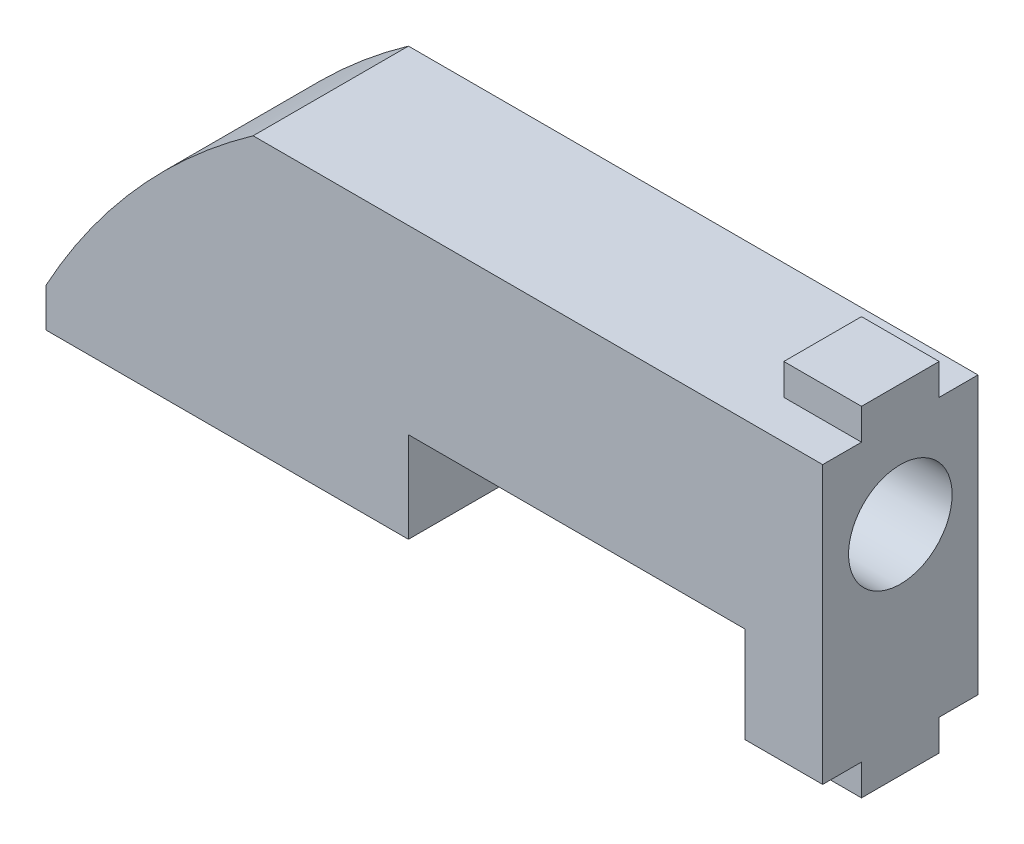
ISO-10303-21;
HEADER;
FILE_DESCRIPTION(('STEP AP214'),'2;1');
FILE_NAME('part.step','',(''),(''),'','','');
FILE_SCHEMA(('AUTOMOTIVE_DESIGN { 1 0 10303 214 1 1 1 1 }'));
ENDSEC;
DATA;
#1=APPLICATION_CONTEXT('core data for automotive mechanical design processes');
#2=APPLICATION_PROTOCOL_DEFINITION('international standard','automotive_design',2000,#1);
#3=PRODUCT_CONTEXT('',#1,'mechanical');
#4=PRODUCT('Part','Part','',(#3));
#5=PRODUCT_RELATED_PRODUCT_CATEGORY('part','',(#4));
#6=PRODUCT_DEFINITION_FORMATION('','',#4);
#7=PRODUCT_DEFINITION_CONTEXT('part definition',#1,'design');
#8=PRODUCT_DEFINITION('design','',#6,#7);
#9=PRODUCT_DEFINITION_SHAPE('','',#8);
#10=(LENGTH_UNIT() NAMED_UNIT(*) SI_UNIT(.MILLI.,.METRE.));
#11=(NAMED_UNIT(*) PLANE_ANGLE_UNIT() SI_UNIT($,.RADIAN.));
#12=(NAMED_UNIT(*) SI_UNIT($,.STERADIAN.) SOLID_ANGLE_UNIT());
#13=UNCERTAINTY_MEASURE_WITH_UNIT(LENGTH_MEASURE(1.E-05),#10,'distance_accuracy_value','');
#14=(GEOMETRIC_REPRESENTATION_CONTEXT(3) GLOBAL_UNCERTAINTY_ASSIGNED_CONTEXT((#13)) GLOBAL_UNIT_ASSIGNED_CONTEXT((#10,
#11,#12)) REPRESENTATION_CONTEXT('',''));
#15=CARTESIAN_POINT('',(0.,0.,0.));
#16=DIRECTION('',(0.,0.,1.));
#17=DIRECTION('',(1.,0.,0.));
#18=AXIS2_PLACEMENT_3D('',#15,#16,#17);
#19=CARTESIAN_POINT('',(30.,10.5,3.));
#20=DIRECTION('',(-1.,0.,0.));
#21=DIRECTION('',(0.,-1.,0.));
#22=AXIS2_PLACEMENT_3D('',#19,#20,#21);
#23=PLANE('',#22);
#24=DIRECTION('',(0.,1.,0.));
#25=VECTOR('',#24,1.);
#26=CARTESIAN_POINT('',(30.,10.5,-3.));
#27=LINE('',#26,#25);
#28=CARTESIAN_POINT('',(30.,-0.199999999999999,-3.));
#29=VERTEX_POINT('',#28);
#30=CARTESIAN_POINT('',(30.,10.5,-3.));
#31=VERTEX_POINT('',#30);
#32=EDGE_CURVE('E318',#29,#31,#27,.T.);
#33=ORIENTED_EDGE('',*,*,#32,.T.);
#34=DIRECTION('',(0.,0.,-1.));
#35=VECTOR('',#34,1.);
#36=CARTESIAN_POINT('',(30.,10.5,3.));
#37=LINE('',#36,#35);
#38=CARTESIAN_POINT('',(30.,10.5,-1.5));
#39=VERTEX_POINT('',#38);
#40=EDGE_CURVE('E258',#39,#31,#37,.T.);
#41=ORIENTED_EDGE('',*,*,#40,.F.);
#42=DIRECTION('',(0.,-1.,0.));
#43=VECTOR('',#42,1.);
#44=CARTESIAN_POINT('',(30.,11.7,-1.5));
#45=LINE('',#44,#43);
#46=CARTESIAN_POINT('',(30.,11.7,-1.5));
#47=VERTEX_POINT('',#46);
#48=EDGE_CURVE('E266',#47,#39,#45,.T.);
#49=ORIENTED_EDGE('',*,*,#48,.F.);
#50=DIRECTION('',(0.,0.,-1.));
#51=VECTOR('',#50,1.);
#52=CARTESIAN_POINT('',(30.,11.7,-1.5));
#53=LINE('',#52,#51);
#54=CARTESIAN_POINT('',(30.,11.7,1.5));
#55=VERTEX_POINT('',#54);
#56=EDGE_CURVE('E276',#55,#47,#53,.T.);
#57=ORIENTED_EDGE('',*,*,#56,.F.);
#58=DIRECTION('',(0.,-1.,0.));
#59=VECTOR('',#58,1.);
#60=CARTESIAN_POINT('',(30.,11.7,1.5));
#61=LINE('',#60,#59);
#62=CARTESIAN_POINT('',(30.,10.5,1.5));
#63=VERTEX_POINT('',#62);
#64=EDGE_CURVE('E277',#55,#63,#61,.T.);
#65=ORIENTED_EDGE('',*,*,#64,.T.);
#66=CARTESIAN_POINT('',(30.,10.5,3.));
#67=VERTEX_POINT('',#66);
#68=EDGE_CURVE('E229',#67,#63,#37,.T.);
#69=ORIENTED_EDGE('',*,*,#68,.F.);
#70=DIRECTION('',(0.,1.,0.));
#71=VECTOR('',#70,1.);
#72=CARTESIAN_POINT('',(30.,10.5,3.));
#73=LINE('',#72,#71);
#74=CARTESIAN_POINT('',(30.,-0.199999999999999,3.));
#75=VERTEX_POINT('',#74);
#76=EDGE_CURVE('E226',#75,#67,#73,.T.);
#77=ORIENTED_EDGE('',*,*,#76,.F.);
#78=DIRECTION('',(0.,0.,-1.));
#79=VECTOR('',#78,1.);
#80=CARTESIAN_POINT('',(30.,-0.199999999999999,3.));
#81=LINE('',#80,#79);
#82=CARTESIAN_POINT('',(30.,-0.199999999999999,1.5));
#83=VERTEX_POINT('',#82);
#84=EDGE_CURVE('E224',#75,#83,#81,.T.);
#85=ORIENTED_EDGE('',*,*,#84,.T.);
#86=DIRECTION('',(0.,1.,0.));
#87=VECTOR('',#86,1.);
#88=CARTESIAN_POINT('',(30.,-1.4,1.5));
#89=LINE('',#88,#87);
#90=CARTESIAN_POINT('',(30.,-1.4,1.5));
#91=VERTEX_POINT('',#90);
#92=EDGE_CURVE('E199',#91,#83,#89,.T.);
#93=ORIENTED_EDGE('',*,*,#92,.F.);
#94=DIRECTION('',(0.,0.,1.));
#95=VECTOR('',#94,1.);
#96=CARTESIAN_POINT('',(30.,-1.4,1.5));
#97=LINE('',#96,#95);
#98=CARTESIAN_POINT('',(30.,-1.4,-1.5));
#99=VERTEX_POINT('',#98);
#100=EDGE_CURVE('E180',#99,#91,#97,.T.);
#101=ORIENTED_EDGE('',*,*,#100,.F.);
#102=DIRECTION('',(0.,1.,0.));
#103=VECTOR('',#102,1.);
#104=CARTESIAN_POINT('',(30.,-1.4,-1.5));
#105=LINE('',#104,#103);
#106=CARTESIAN_POINT('',(30.,-0.199999999999999,-1.5));
#107=VERTEX_POINT('',#106);
#108=EDGE_CURVE('E195',#99,#107,#105,.T.);
#109=ORIENTED_EDGE('',*,*,#108,.T.);
#110=EDGE_CURVE('E227',#107,#29,#81,.T.);
#111=ORIENTED_EDGE('',*,*,#110,.T.);
#112=EDGE_LOOP('',(#33,#41,#49,#57,#65,#69,#77,#85,#93,#101,#109,#111));
#113=FACE_BOUND('',#112,.T.);
#114=CARTESIAN_POINT('',(30.,7.,0.));
#115=DIRECTION('',(1.,0.,0.));
#116=DIRECTION('',(0.,0.,-1.));
#117=AXIS2_PLACEMENT_3D('',#114,#115,#116);
#118=CIRCLE('',#117,2.);
#119=CARTESIAN_POINT('',(30.,7.,-2.));
#120=VERTEX_POINT('',#119);
#121=EDGE_CURVE('E169',#120,#120,#118,.T.);
#122=ORIENTED_EDGE('',*,*,#121,.F.);
#123=EDGE_LOOP('',(#122));
#124=FACE_BOUND('',#123,.T.);
#125=ADVANCED_FACE('F37',(#113,#124),#23,.F.);
#126=CARTESIAN_POINT('',(27.,-0.199999999999999,3.));
#127=DIRECTION('',(0.,1.,0.));
#128=DIRECTION('',(0.,0.,1.));
#129=AXIS2_PLACEMENT_3D('',#126,#127,#128);
#130=PLANE('',#129);
#131=DIRECTION('',(-1.,0.,0.));
#132=VECTOR('',#131,1.);
#133=CARTESIAN_POINT('',(27.,-0.199999999999999,1.5));
#134=LINE('',#133,#132);
#135=CARTESIAN_POINT('',(27.,-0.199999999999999,1.5));
#136=VERTEX_POINT('',#135);
#137=EDGE_CURVE('E178',#83,#136,#134,.T.);
#138=ORIENTED_EDGE('',*,*,#137,.F.);
#139=ORIENTED_EDGE('',*,*,#84,.F.);
#140=DIRECTION('',(1.,0.,0.));
#141=VECTOR('',#140,1.);
#142=CARTESIAN_POINT('',(27.,-0.199999999999999,3.));
#143=LINE('',#142,#141);
#144=CARTESIAN_POINT('',(27.,-0.199999999999999,3.));
#145=VERTEX_POINT('',#144);
#146=EDGE_CURVE('E297',#145,#75,#143,.T.);
#147=ORIENTED_EDGE('',*,*,#146,.F.);
#148=DIRECTION('',(0.,0.,-1.));
#149=VECTOR('',#148,1.);
#150=CARTESIAN_POINT('',(27.,-0.199999999999999,3.));
#151=LINE('',#150,#149);
#152=EDGE_CURVE('E62',#145,#136,#151,.T.);
#153=ORIENTED_EDGE('',*,*,#152,.T.);
#154=EDGE_LOOP('',(#138,#139,#147,#153));
#155=FACE_BOUND('',#154,.T.);
#156=ADVANCED_FACE('F395',(#155),#130,.F.);
#157=DIRECTION('',(1.,0.,0.));
#158=VECTOR('',#157,1.);
#159=CARTESIAN_POINT('',(27.,-0.199999999999999,-1.5));
#160=LINE('',#159,#158);
#161=CARTESIAN_POINT('',(27.,-0.199999999999999,-1.5));
#162=VERTEX_POINT('',#161);
#163=EDGE_CURVE('E54',#162,#107,#160,.T.);
#164=ORIENTED_EDGE('',*,*,#163,.F.);
#165=CARTESIAN_POINT('',(27.,-0.199999999999999,-3.));
#166=VERTEX_POINT('',#165);
#167=EDGE_CURVE('E192',#162,#166,#151,.T.);
#168=ORIENTED_EDGE('',*,*,#167,.T.);
#169=DIRECTION('',(1.,0.,0.));
#170=VECTOR('',#169,1.);
#171=CARTESIAN_POINT('',(27.,-0.199999999999999,-3.));
#172=LINE('',#171,#170);
#173=EDGE_CURVE('E315',#166,#29,#172,.T.);
#174=ORIENTED_EDGE('',*,*,#173,.T.);
#175=ORIENTED_EDGE('',*,*,#110,.F.);
#176=EDGE_LOOP('',(#164,#168,#174,#175));
#177=FACE_BOUND('',#176,.T.);
#178=ADVANCED_FACE('F380',(#177),#130,.F.);
#179=CARTESIAN_POINT('',(8.,10.5,3.));
#180=DIRECTION('',(0.,-1.,0.));
#181=DIRECTION('',(0.,0.,-1.));
#182=AXIS2_PLACEMENT_3D('',#179,#180,#181);
#183=PLANE('',#182);
#184=DIRECTION('',(1.,0.,0.));
#185=VECTOR('',#184,1.);
#186=CARTESIAN_POINT('',(30.,10.5,1.5));
#187=LINE('',#186,#185);
#188=CARTESIAN_POINT('',(27.,10.5,1.5));
#189=VERTEX_POINT('',#188);
#190=EDGE_CURVE('E273',#189,#63,#187,.T.);
#191=ORIENTED_EDGE('',*,*,#190,.F.);
#192=DIRECTION('',(0.,0.,1.));
#193=VECTOR('',#192,1.);
#194=CARTESIAN_POINT('',(27.,10.5,-1.5));
#195=LINE('',#194,#193);
#196=CARTESIAN_POINT('',(27.,10.5,-1.5));
#197=VERTEX_POINT('',#196);
#198=EDGE_CURVE('E263',#197,#189,#195,.T.);
#199=ORIENTED_EDGE('',*,*,#198,.F.);
#200=DIRECTION('',(-1.,0.,0.));
#201=VECTOR('',#200,1.);
#202=CARTESIAN_POINT('',(30.,10.5,-1.5));
#203=LINE('',#202,#201);
#204=EDGE_CURVE('E204',#39,#197,#203,.T.);
#205=ORIENTED_EDGE('',*,*,#204,.F.);
#206=ORIENTED_EDGE('',*,*,#40,.T.);
#207=DIRECTION('',(-1.,0.,0.));
#208=VECTOR('',#207,1.);
#209=CARTESIAN_POINT('',(8.,10.5,-3.));
#210=LINE('',#209,#208);
#211=CARTESIAN_POINT('',(8.,10.5,-3.));
#212=VERTEX_POINT('',#211);
#213=EDGE_CURVE('E320',#31,#212,#210,.T.);
#214=ORIENTED_EDGE('',*,*,#213,.T.);
#215=DIRECTION('',(0.,0.,-1.));
#216=VECTOR('',#215,1.);
#217=CARTESIAN_POINT('',(8.,10.5,3.));
#218=LINE('',#217,#216);
#219=CARTESIAN_POINT('',(8.,10.5,3.));
#220=VERTEX_POINT('',#219);
#221=EDGE_CURVE('E260',#220,#212,#218,.T.);
#222=ORIENTED_EDGE('',*,*,#221,.F.);
#223=DIRECTION('',(-1.,0.,0.));
#224=VECTOR('',#223,1.);
#225=CARTESIAN_POINT('',(8.,10.5,3.));
#226=LINE('',#225,#224);
#227=EDGE_CURVE('E300',#67,#220,#226,.T.);
#228=ORIENTED_EDGE('',*,*,#227,.F.);
#229=ORIENTED_EDGE('',*,*,#68,.T.);
#230=EDGE_LOOP('',(#191,#199,#205,#206,#214,#222,#228,#229));
#231=FACE_BOUND('',#230,.T.);
#232=ADVANCED_FACE('F354',(#231),#183,.F.);
#233=CARTESIAN_POINT('',(14.,0.,3.));
#234=DIRECTION('',(0.,1.,0.));
#235=DIRECTION('',(-1.,0.,0.));
#236=AXIS2_PLACEMENT_3D('',#233,#234,#235);
#237=PLANE('',#236);
#238=DIRECTION('',(1.,0.,0.));
#239=VECTOR('',#238,1.);
#240=CARTESIAN_POINT('',(14.,0.,-3.));
#241=LINE('',#240,#239);
#242=CARTESIAN_POINT('',(0.,0.,-3.));
#243=VERTEX_POINT('',#242);
#244=CARTESIAN_POINT('',(14.,0.,-3.));
#245=VERTEX_POINT('',#244);
#246=EDGE_CURVE('E269',#243,#245,#241,.T.);
#247=ORIENTED_EDGE('',*,*,#246,.T.);
#248=DIRECTION('',(0.,0.,-1.));
#249=VECTOR('',#248,1.);
#250=CARTESIAN_POINT('',(14.,0.,3.));
#251=LINE('',#250,#249);
#252=CARTESIAN_POINT('',(14.,0.,3.));
#253=VERTEX_POINT('',#252);
#254=EDGE_CURVE('E11',#253,#245,#251,.T.);
#255=ORIENTED_EDGE('',*,*,#254,.F.);
#256=DIRECTION('',(1.,0.,0.));
#257=VECTOR('',#256,1.);
#258=CARTESIAN_POINT('',(14.,0.,3.));
#259=LINE('',#258,#257);
#260=CARTESIAN_POINT('',(0.,0.,3.));
#261=VERTEX_POINT('',#260);
#262=EDGE_CURVE('E287',#261,#253,#259,.T.);
#263=ORIENTED_EDGE('',*,*,#262,.F.);
#264=DIRECTION('',(0.,0.,-1.));
#265=VECTOR('',#264,1.);
#266=CARTESIAN_POINT('',(0.,0.,3.));
#267=LINE('',#266,#265);
#268=EDGE_CURVE('E306',#261,#243,#267,.T.);
#269=ORIENTED_EDGE('',*,*,#268,.T.);
#270=EDGE_LOOP('',(#247,#255,#263,#269));
#271=FACE_BOUND('',#270,.T.);
#272=ADVANCED_FACE('F39',(#271),#237,.F.);
#273=CARTESIAN_POINT('',(14.,3.5,3.));
#274=DIRECTION('',(-1.,0.,0.));
#275=DIRECTION('',(0.,-1.,0.));
#276=AXIS2_PLACEMENT_3D('',#273,#274,#275);
#277=PLANE('',#276);
#278=DIRECTION('',(0.,1.,0.));
#279=VECTOR('',#278,1.);
#280=CARTESIAN_POINT('',(14.,3.5,-3.));
#281=LINE('',#280,#279);
#282=CARTESIAN_POINT('',(14.,3.5,-3.));
#283=VERTEX_POINT('',#282);
#284=EDGE_CURVE('E309',#245,#283,#281,.T.);
#285=ORIENTED_EDGE('',*,*,#284,.T.);
#286=DIRECTION('',(0.,0.,-1.));
#287=VECTOR('',#286,1.);
#288=CARTESIAN_POINT('',(14.,3.5,3.));
#289=LINE('',#288,#287);
#290=CARTESIAN_POINT('',(14.,3.5,3.));
#291=VERTEX_POINT('',#290);
#292=EDGE_CURVE('E46',#291,#283,#289,.T.);
#293=ORIENTED_EDGE('',*,*,#292,.F.);
#294=DIRECTION('',(0.,1.,0.));
#295=VECTOR('',#294,1.);
#296=CARTESIAN_POINT('',(14.,3.5,3.));
#297=LINE('',#296,#295);
#298=EDGE_CURVE('E290',#253,#291,#297,.T.);
#299=ORIENTED_EDGE('',*,*,#298,.F.);
#300=ORIENTED_EDGE('',*,*,#254,.T.);
#301=EDGE_LOOP('',(#285,#293,#299,#300));
#302=FACE_BOUND('',#301,.T.);
#303=ADVANCED_FACE('F391',(#302),#277,.F.);
#304=CARTESIAN_POINT('',(27.,3.5,3.));
#305=DIRECTION('',(0.,1.,0.));
#306=DIRECTION('',(-1.,0.,0.));
#307=AXIS2_PLACEMENT_3D('',#304,#305,#306);
#308=PLANE('',#307);
#309=DIRECTION('',(1.,0.,0.));
#310=VECTOR('',#309,1.);
#311=CARTESIAN_POINT('',(27.,3.5,-3.));
#312=LINE('',#311,#310);
#313=CARTESIAN_POINT('',(27.,3.5,-3.));
#314=VERTEX_POINT('',#313);
#315=EDGE_CURVE('E311',#283,#314,#312,.T.);
#316=ORIENTED_EDGE('',*,*,#315,.T.);
#317=DIRECTION('',(0.,0.,-1.));
#318=VECTOR('',#317,1.);
#319=CARTESIAN_POINT('',(27.,3.5,3.));
#320=LINE('',#319,#318);
#321=CARTESIAN_POINT('',(27.,3.5,3.));
#322=VERTEX_POINT('',#321);
#323=EDGE_CURVE('E242',#322,#314,#320,.T.);
#324=ORIENTED_EDGE('',*,*,#323,.F.);
#325=DIRECTION('',(1.,0.,0.));
#326=VECTOR('',#325,1.);
#327=CARTESIAN_POINT('',(27.,3.5,3.));
#328=LINE('',#327,#326);
#329=EDGE_CURVE('E293',#291,#322,#328,.T.);
#330=ORIENTED_EDGE('',*,*,#329,.F.);
#331=ORIENTED_EDGE('',*,*,#292,.T.);
#332=EDGE_LOOP('',(#316,#324,#330,#331));
#333=FACE_BOUND('',#332,.T.);
#334=ADVANCED_FACE('F384',(#333),#308,.F.);
#335=CARTESIAN_POINT('',(27.,-0.199999999999999,3.));
#336=DIRECTION('',(1.,0.,0.));
#337=DIRECTION('',(0.,1.,0.));
#338=AXIS2_PLACEMENT_3D('',#335,#336,#337);
#339=PLANE('',#338);
#340=DIRECTION('',(0.,-1.,0.));
#341=VECTOR('',#340,1.);
#342=CARTESIAN_POINT('',(27.,-0.199999999999999,-3.));
#343=LINE('',#342,#341);
#344=EDGE_CURVE('E313',#314,#166,#343,.T.);
#345=ORIENTED_EDGE('',*,*,#344,.T.);
#346=ORIENTED_EDGE('',*,*,#167,.F.);
#347=DIRECTION('',(0.,1.,0.));
#348=VECTOR('',#347,1.);
#349=CARTESIAN_POINT('',(27.,-1.4,-1.5));
#350=LINE('',#349,#348);
#351=CARTESIAN_POINT('',(27.,-1.4,-1.5));
#352=VERTEX_POINT('',#351);
#353=EDGE_CURVE('E198',#352,#162,#350,.T.);
#354=ORIENTED_EDGE('',*,*,#353,.F.);
#355=DIRECTION('',(0.,0.,-1.));
#356=VECTOR('',#355,1.);
#357=CARTESIAN_POINT('',(27.,-1.4,1.5));
#358=LINE('',#357,#356);
#359=CARTESIAN_POINT('',(27.,-1.4,1.5));
#360=VERTEX_POINT('',#359);
#361=EDGE_CURVE('E174',#360,#352,#358,.T.);
#362=ORIENTED_EDGE('',*,*,#361,.F.);
#363=DIRECTION('',(0.,1.,0.));
#364=VECTOR('',#363,1.);
#365=CARTESIAN_POINT('',(27.,-1.4,1.5));
#366=LINE('',#365,#364);
#367=EDGE_CURVE('E184',#360,#136,#366,.T.);
#368=ORIENTED_EDGE('',*,*,#367,.T.);
#369=ORIENTED_EDGE('',*,*,#152,.F.);
#370=DIRECTION('',(0.,-1.,0.));
#371=VECTOR('',#370,1.);
#372=CARTESIAN_POINT('',(27.,-0.199999999999999,3.));
#373=LINE('',#372,#371);
#374=EDGE_CURVE('E295',#322,#145,#373,.T.);
#375=ORIENTED_EDGE('',*,*,#374,.F.);
#376=ORIENTED_EDGE('',*,*,#323,.T.);
#377=EDGE_LOOP('',(#345,#346,#354,#362,#368,#369,#375,#376));
#378=FACE_BOUND('',#377,.T.);
#379=ADVANCED_FACE('F382',(#378),#339,.F.);
#380=CARTESIAN_POINT('',(23.3665507302786,-11.2147117602476,3.));
#381=DIRECTION('',(0.,0.,-1.));
#382=DIRECTION('',(-1.,0.,0.));
#383=AXIS2_PLACEMENT_3D('',#380,#381,#382);
#384=CYLINDRICAL_SURFACE('',#383,26.6018718923474);
#385=CARTESIAN_POINT('',(23.3665507302786,-11.2147117602476,-3.));
#386=DIRECTION('',(0.,0.,1.));
#387=DIRECTION('',(1.,0.,0.));
#388=AXIS2_PLACEMENT_3D('',#385,#386,#387);
#389=CIRCLE('',#388,26.6018718923474);
#390=CARTESIAN_POINT('',(0.,1.5,-3.));
#391=VERTEX_POINT('',#390);
#392=EDGE_CURVE('E322',#212,#391,#389,.T.);
#393=ORIENTED_EDGE('',*,*,#392,.T.);
#394=DIRECTION('',(0.,0.,-1.));
#395=VECTOR('',#394,1.);
#396=CARTESIAN_POINT('',(0.,1.5,3.));
#397=LINE('',#396,#395);
#398=CARTESIAN_POINT('',(0.,1.5,3.));
#399=VERTEX_POINT('',#398);
#400=EDGE_CURVE('E327',#399,#391,#397,.T.);
#401=ORIENTED_EDGE('',*,*,#400,.F.);
#402=CARTESIAN_POINT('',(23.3665507302786,-11.2147117602476,3.));
#403=DIRECTION('',(0.,0.,1.));
#404=DIRECTION('',(1.,0.,0.));
#405=AXIS2_PLACEMENT_3D('',#402,#403,#404);
#406=CIRCLE('',#405,26.6018718923474);
#407=EDGE_CURVE('E302',#220,#399,#406,.T.);
#408=ORIENTED_EDGE('',*,*,#407,.F.);
#409=ORIENTED_EDGE('',*,*,#221,.T.);
#410=EDGE_LOOP('',(#393,#401,#408,#409));
#411=FACE_BOUND('',#410,.T.);
#412=ADVANCED_FACE('F335',(#411),#384,.T.);
#413=CARTESIAN_POINT('',(0.,0.,3.));
#414=DIRECTION('',(1.,0.,0.));
#415=DIRECTION('',(0.,0.,-1.));
#416=AXIS2_PLACEMENT_3D('',#413,#414,#415);
#417=PLANE('',#416);
#418=DIRECTION('',(0.,-1.,0.));
#419=VECTOR('',#418,1.);
#420=CARTESIAN_POINT('',(0.,0.,-3.));
#421=LINE('',#420,#419);
#422=EDGE_CURVE('E291',#391,#243,#421,.T.);
#423=ORIENTED_EDGE('',*,*,#422,.T.);
#424=ORIENTED_EDGE('',*,*,#268,.F.);
#425=DIRECTION('',(0.,-1.,0.));
#426=VECTOR('',#425,1.);
#427=CARTESIAN_POINT('',(0.,0.,3.));
#428=LINE('',#427,#426);
#429=EDGE_CURVE('E304',#399,#261,#428,.T.);
#430=ORIENTED_EDGE('',*,*,#429,.F.);
#431=ORIENTED_EDGE('',*,*,#400,.T.);
#432=EDGE_LOOP('',(#423,#424,#430,#431));
#433=FACE_BOUND('',#432,.T.);
#434=ADVANCED_FACE('F347',(#433),#417,.F.);
#435=CARTESIAN_POINT('',(23.3665507302786,-11.2147117602476,3.));
#436=DIRECTION('',(0.,0.,1.));
#437=DIRECTION('',(1.,0.,0.));
#438=AXIS2_PLACEMENT_3D('',#435,#436,#437);
#439=PLANE('',#438);
#440=ORIENTED_EDGE('',*,*,#262,.T.);
#441=ORIENTED_EDGE('',*,*,#298,.T.);
#442=ORIENTED_EDGE('',*,*,#329,.T.);
#443=ORIENTED_EDGE('',*,*,#374,.T.);
#444=ORIENTED_EDGE('',*,*,#146,.T.);
#445=ORIENTED_EDGE('',*,*,#76,.T.);
#446=ORIENTED_EDGE('',*,*,#227,.T.);
#447=ORIENTED_EDGE('',*,*,#407,.T.);
#448=ORIENTED_EDGE('',*,*,#429,.T.);
#449=EDGE_LOOP('',(#440,#441,#442,#443,#444,#445,#446,#447,#448));
#450=FACE_BOUND('',#449,.T.);
#451=ADVANCED_FACE('F353',(#450),#439,.T.);
#452=CARTESIAN_POINT('',(23.3665507302786,-11.2147117602476,-3.));
#453=DIRECTION('',(0.,0.,1.));
#454=DIRECTION('',(1.,0.,0.));
#455=AXIS2_PLACEMENT_3D('',#452,#453,#454);
#456=PLANE('',#455);
#457=ORIENTED_EDGE('',*,*,#246,.F.);
#458=ORIENTED_EDGE('',*,*,#422,.F.);
#459=ORIENTED_EDGE('',*,*,#392,.F.);
#460=ORIENTED_EDGE('',*,*,#213,.F.);
#461=ORIENTED_EDGE('',*,*,#32,.F.);
#462=ORIENTED_EDGE('',*,*,#173,.F.);
#463=ORIENTED_EDGE('',*,*,#344,.F.);
#464=ORIENTED_EDGE('',*,*,#315,.F.);
#465=ORIENTED_EDGE('',*,*,#284,.F.);
#466=EDGE_LOOP('',(#457,#458,#459,#460,#461,#462,#463,#464,#465));
#467=FACE_BOUND('',#466,.T.);
#468=ADVANCED_FACE('F343',(#467),#456,.F.);
#469=CARTESIAN_POINT('',(30.,11.7,-1.5));
#470=DIRECTION('',(0.,0.,1.));
#471=DIRECTION('',(1.,0.,0.));
#472=AXIS2_PLACEMENT_3D('',#469,#470,#471);
#473=PLANE('',#472);
#474=ORIENTED_EDGE('',*,*,#204,.T.);
#475=DIRECTION('',(0.,-1.,0.));
#476=VECTOR('',#475,1.);
#477=CARTESIAN_POINT('',(27.,11.7,-1.5));
#478=LINE('',#477,#476);
#479=CARTESIAN_POINT('',(27.,11.7,-1.5));
#480=VERTEX_POINT('',#479);
#481=EDGE_CURVE('E270',#480,#197,#478,.T.);
#482=ORIENTED_EDGE('',*,*,#481,.F.);
#483=DIRECTION('',(-1.,0.,0.));
#484=VECTOR('',#483,1.);
#485=CARTESIAN_POINT('',(30.,11.7,-1.5));
#486=LINE('',#485,#484);
#487=EDGE_CURVE('E368',#47,#480,#486,.T.);
#488=ORIENTED_EDGE('',*,*,#487,.F.);
#489=ORIENTED_EDGE('',*,*,#48,.T.);
#490=EDGE_LOOP('',(#474,#482,#488,#489));
#491=FACE_BOUND('',#490,.T.);
#492=ADVANCED_FACE('F375',(#491),#473,.F.);
#493=CARTESIAN_POINT('',(27.,11.7,-1.5));
#494=DIRECTION('',(1.,0.,0.));
#495=DIRECTION('',(0.,0.,-1.));
#496=AXIS2_PLACEMENT_3D('',#493,#494,#495);
#497=PLANE('',#496);
#498=ORIENTED_EDGE('',*,*,#198,.T.);
#499=DIRECTION('',(0.,-1.,0.));
#500=VECTOR('',#499,1.);
#501=CARTESIAN_POINT('',(27.,11.7,1.5));
#502=LINE('',#501,#500);
#503=CARTESIAN_POINT('',(27.,11.7,1.5));
#504=VERTEX_POINT('',#503);
#505=EDGE_CURVE('E282',#504,#189,#502,.T.);
#506=ORIENTED_EDGE('',*,*,#505,.F.);
#507=DIRECTION('',(0.,0.,1.));
#508=VECTOR('',#507,1.);
#509=CARTESIAN_POINT('',(27.,11.7,-1.5));
#510=LINE('',#509,#508);
#511=EDGE_CURVE('E366',#480,#504,#510,.T.);
#512=ORIENTED_EDGE('',*,*,#511,.F.);
#513=ORIENTED_EDGE('',*,*,#481,.T.);
#514=EDGE_LOOP('',(#498,#506,#512,#513));
#515=FACE_BOUND('',#514,.T.);
#516=ADVANCED_FACE('F378',(#515),#497,.F.);
#517=CARTESIAN_POINT('',(30.,11.7,1.5));
#518=DIRECTION('',(0.,0.,-1.));
#519=DIRECTION('',(-1.,0.,0.));
#520=AXIS2_PLACEMENT_3D('',#517,#518,#519);
#521=PLANE('',#520);
#522=ORIENTED_EDGE('',*,*,#190,.T.);
#523=ORIENTED_EDGE('',*,*,#64,.F.);
#524=DIRECTION('',(1.,0.,0.));
#525=VECTOR('',#524,1.);
#526=CARTESIAN_POINT('',(30.,11.7,1.5));
#527=LINE('',#526,#525);
#528=EDGE_CURVE('E365',#504,#55,#527,.T.);
#529=ORIENTED_EDGE('',*,*,#528,.F.);
#530=ORIENTED_EDGE('',*,*,#505,.T.);
#531=EDGE_LOOP('',(#522,#523,#529,#530));
#532=FACE_BOUND('',#531,.T.);
#533=ADVANCED_FACE('F359',(#532),#521,.F.);
#534=CARTESIAN_POINT('',(30.,11.7,1.5));
#535=DIRECTION('',(0.,-1.,0.));
#536=DIRECTION('',(0.,0.,-1.));
#537=AXIS2_PLACEMENT_3D('',#534,#535,#536);
#538=PLANE('',#537);
#539=ORIENTED_EDGE('',*,*,#56,.T.);
#540=ORIENTED_EDGE('',*,*,#487,.T.);
#541=ORIENTED_EDGE('',*,*,#511,.T.);
#542=ORIENTED_EDGE('',*,*,#528,.T.);
#543=EDGE_LOOP('',(#539,#540,#541,#542));
#544=FACE_BOUND('',#543,.T.);
#545=ADVANCED_FACE('F371',(#544),#538,.F.);
#546=CARTESIAN_POINT('',(27.,-1.4,-1.5));
#547=DIRECTION('',(0.,0.,1.));
#548=DIRECTION('',(1.,0.,0.));
#549=AXIS2_PLACEMENT_3D('',#546,#547,#548);
#550=PLANE('',#549);
#551=ORIENTED_EDGE('',*,*,#163,.T.);
#552=ORIENTED_EDGE('',*,*,#108,.F.);
#553=DIRECTION('',(1.,0.,0.));
#554=VECTOR('',#553,1.);
#555=CARTESIAN_POINT('',(27.,-1.4,-1.5));
#556=LINE('',#555,#554);
#557=EDGE_CURVE('E177',#352,#99,#556,.T.);
#558=ORIENTED_EDGE('',*,*,#557,.F.);
#559=ORIENTED_EDGE('',*,*,#353,.T.);
#560=EDGE_LOOP('',(#551,#552,#558,#559));
#561=FACE_BOUND('',#560,.T.);
#562=ADVANCED_FACE('F417',(#561),#550,.F.);
#563=CARTESIAN_POINT('',(27.,-1.4,1.5));
#564=DIRECTION('',(0.,0.,-1.));
#565=DIRECTION('',(-1.,0.,0.));
#566=AXIS2_PLACEMENT_3D('',#563,#564,#565);
#567=PLANE('',#566);
#568=ORIENTED_EDGE('',*,*,#137,.T.);
#569=ORIENTED_EDGE('',*,*,#367,.F.);
#570=DIRECTION('',(-1.,0.,0.));
#571=VECTOR('',#570,1.);
#572=CARTESIAN_POINT('',(27.,-1.4,1.5));
#573=LINE('',#572,#571);
#574=EDGE_CURVE('E182',#91,#360,#573,.T.);
#575=ORIENTED_EDGE('',*,*,#574,.F.);
#576=ORIENTED_EDGE('',*,*,#92,.T.);
#577=EDGE_LOOP('',(#568,#569,#575,#576));
#578=FACE_BOUND('',#577,.T.);
#579=ADVANCED_FACE('F215',(#578),#567,.F.);
#580=CARTESIAN_POINT('',(27.,-1.4,-1.5));
#581=DIRECTION('',(0.,-1.,0.));
#582=DIRECTION('',(0.,0.,-1.));
#583=AXIS2_PLACEMENT_3D('',#580,#581,#582);
#584=PLANE('',#583);
#585=ORIENTED_EDGE('',*,*,#361,.T.);
#586=ORIENTED_EDGE('',*,*,#557,.T.);
#587=ORIENTED_EDGE('',*,*,#100,.T.);
#588=ORIENTED_EDGE('',*,*,#574,.T.);
#589=EDGE_LOOP('',(#585,#586,#587,#588));
#590=FACE_BOUND('',#589,.T.);
#591=ADVANCED_FACE('F423',(#590),#584,.T.);
#592=CARTESIAN_POINT('',(30.,7.,0.));
#593=DIRECTION('',(1.,0.,0.));
#594=DIRECTION('',(0.,0.,-1.));
#595=AXIS2_PLACEMENT_3D('',#592,#593,#594);
#596=CYLINDRICAL_SURFACE('',#595,2.);
#597=CARTESIAN_POINT('',(27.,7.,0.));
#598=DIRECTION('',(1.,0.,0.));
#599=DIRECTION('',(0.,0.,-1.));
#600=AXIS2_PLACEMENT_3D('',#597,#598,#599);
#601=CIRCLE('',#600,2.);
#602=CARTESIAN_POINT('',(27.,7.,-2.));
#603=VERTEX_POINT('',#602);
#604=EDGE_CURVE('E167',#603,#603,#601,.T.);
#605=ORIENTED_EDGE('',*,*,#604,.F.);
#606=EDGE_LOOP('',(#605));
#607=FACE_BOUND('',#606,.T.);
#608=ORIENTED_EDGE('',*,*,#121,.T.);
#609=EDGE_LOOP('',(#608));
#610=FACE_BOUND('',#609,.T.);
#611=ADVANCED_FACE('F163',(#607,#610),#596,.F.);
#612=CARTESIAN_POINT('',(27.,7.,0.));
#613=DIRECTION('',(1.,0.,0.));
#614=DIRECTION('',(0.,0.,-1.));
#615=AXIS2_PLACEMENT_3D('',#612,#613,#614);
#616=CONICAL_SURFACE('',#615,2.,1.02974425867665);
#617=CARTESIAN_POINT('',(25.7982787619449,7.,0.));
#618=VERTEX_POINT('',#617);
#619=VERTEX_LOOP('',#618);
#620=FACE_BOUND('',#619,.T.);
#621=ORIENTED_EDGE('',*,*,#604,.T.);
#622=EDGE_LOOP('',(#621));
#623=FACE_BOUND('',#622,.T.);
#624=ADVANCED_FACE('F160',(#620,#623),#616,.F.);
#625=CLOSED_SHELL('',(#125,#156,#178,#232,#272,#303,#334,#379,#412,#434,#451,#468,#492,#516,
#533,#545,#562,#579,#591,#611,#624));
#626=MANIFOLD_SOLID_BREP('B2',#625);
#627=ADVANCED_BREP_SHAPE_REPRESENTATION('',(#18,#626),#14);
#628=SHAPE_DEFINITION_REPRESENTATION(#9,#627);
ENDSEC;
END-ISO-10303-21;
